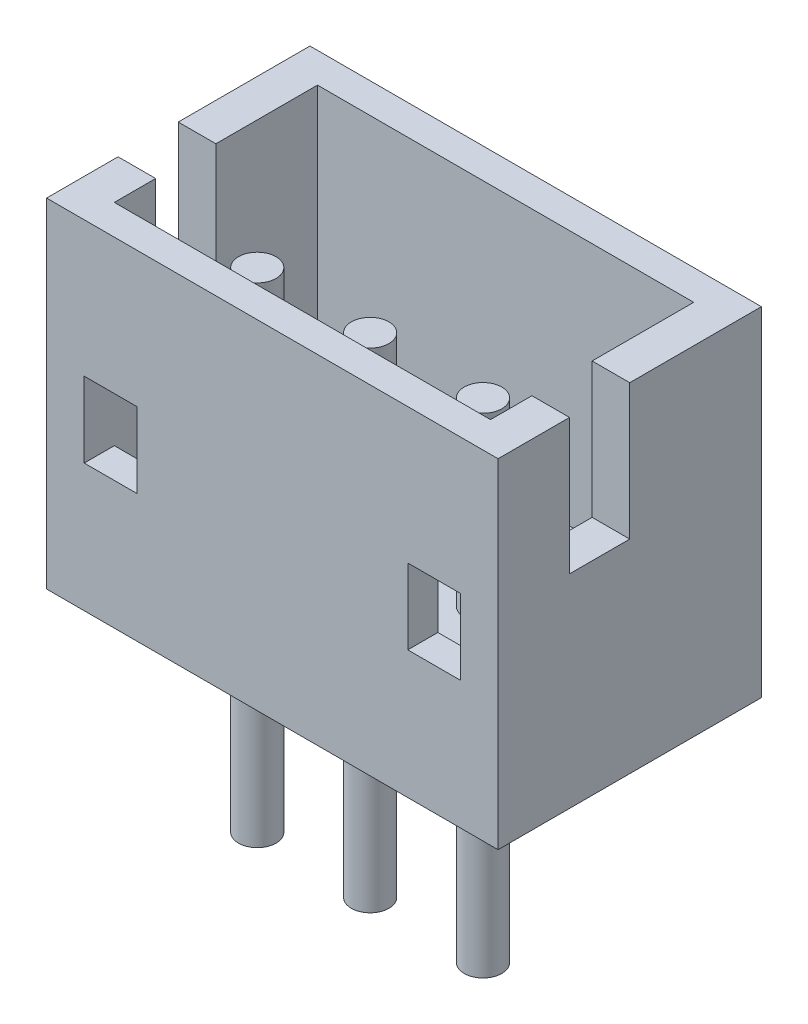
ISO-10303-21;
HEADER;
FILE_DESCRIPTION(('STEP AP214'),'2;1');
FILE_NAME('part.step','',(''),(''),'','','');
FILE_SCHEMA(('AUTOMOTIVE_DESIGN { 1 0 10303 214 1 1 1 1 }'));
ENDSEC;
DATA;
#1=APPLICATION_CONTEXT('core data for automotive mechanical design processes');
#2=APPLICATION_PROTOCOL_DEFINITION('international standard','automotive_design',2000,#1);
#3=PRODUCT_CONTEXT('',#1,'mechanical');
#4=PRODUCT('Part','Part','',(#3));
#5=PRODUCT_RELATED_PRODUCT_CATEGORY('part','',(#4));
#6=PRODUCT_DEFINITION_FORMATION('','',#4);
#7=PRODUCT_DEFINITION_CONTEXT('part definition',#1,'design');
#8=PRODUCT_DEFINITION('design','',#6,#7);
#9=PRODUCT_DEFINITION_SHAPE('','',#8);
#10=(LENGTH_UNIT() NAMED_UNIT(*) SI_UNIT(.MILLI.,.METRE.));
#11=(NAMED_UNIT(*) PLANE_ANGLE_UNIT() SI_UNIT($,.RADIAN.));
#12=(NAMED_UNIT(*) SI_UNIT($,.STERADIAN.) SOLID_ANGLE_UNIT());
#13=UNCERTAINTY_MEASURE_WITH_UNIT(LENGTH_MEASURE(1.E-05),#10,'distance_accuracy_value','');
#14=(GEOMETRIC_REPRESENTATION_CONTEXT(3) GLOBAL_UNCERTAINTY_ASSIGNED_CONTEXT((#13)) GLOBAL_UNIT_ASSIGNED_CONTEXT((#10,
#11,#12)) REPRESENTATION_CONTEXT('',''));
#15=CARTESIAN_POINT('',(0.,0.,0.));
#16=DIRECTION('',(0.,0.,1.));
#17=DIRECTION('',(1.,0.,0.));
#18=AXIS2_PLACEMENT_3D('',#15,#16,#17);
#19=CARTESIAN_POINT('',(1.8,4.5,-0.4));
#20=DIRECTION('',(0.,1.,0.));
#21=DIRECTION('',(0.,0.,1.));
#22=AXIS2_PLACEMENT_3D('',#19,#20,#21);
#23=PLANE('',#22);
#24=DIRECTION('',(-1.,0.,0.));
#25=VECTOR('',#24,1.);
#26=CARTESIAN_POINT('',(3.,4.5,-0.95));
#27=LINE('',#26,#25);
#28=CARTESIAN_POINT('',(-2.5,4.5,-0.95));
#29=VERTEX_POINT('',#28);
#30=CARTESIAN_POINT('',(-3.,4.5,-0.95));
#31=VERTEX_POINT('',#30);
#32=EDGE_CURVE('E209',#29,#31,#27,.T.);
#33=ORIENTED_EDGE('',*,*,#32,.T.);
#34=DIRECTION('',(0.,0.,-1.));
#35=VECTOR('',#34,1.);
#36=CARTESIAN_POINT('',(-3.,4.5,-3.1));
#37=LINE('',#36,#35);
#38=CARTESIAN_POINT('',(-3.,4.5,0.));
#39=VERTEX_POINT('',#38);
#40=EDGE_CURVE('E224',#39,#31,#37,.T.);
#41=ORIENTED_EDGE('',*,*,#40,.F.);
#42=DIRECTION('',(-1.,0.,0.));
#43=VECTOR('',#42,1.);
#44=CARTESIAN_POINT('',(1.8,4.5,0.));
#45=LINE('',#44,#43);
#46=CARTESIAN_POINT('',(3.,4.5,0.));
#47=VERTEX_POINT('',#46);
#48=EDGE_CURVE('E319',#47,#39,#45,.T.);
#49=ORIENTED_EDGE('',*,*,#48,.F.);
#50=DIRECTION('',(0.,0.,1.));
#51=VECTOR('',#50,1.);
#52=CARTESIAN_POINT('',(3.,4.5,0.));
#53=LINE('',#52,#51);
#54=CARTESIAN_POINT('',(3.,4.5,-0.95));
#55=VERTEX_POINT('',#54);
#56=EDGE_CURVE('E265',#55,#47,#53,.T.);
#57=ORIENTED_EDGE('',*,*,#56,.F.);
#58=DIRECTION('',(1.,0.,0.));
#59=VECTOR('',#58,1.);
#60=CARTESIAN_POINT('',(-3.001,4.5,-0.95));
#61=LINE('',#60,#59);
#62=CARTESIAN_POINT('',(2.5,4.5,-0.95));
#63=VERTEX_POINT('',#62);
#64=EDGE_CURVE('E55',#63,#55,#61,.T.);
#65=ORIENTED_EDGE('',*,*,#64,.F.);
#66=DIRECTION('',(0.,0.,1.));
#67=VECTOR('',#66,1.);
#68=CARTESIAN_POINT('',(2.5,4.5,0.));
#69=LINE('',#68,#67);
#70=CARTESIAN_POINT('',(2.5,4.5,-0.400000000000001));
#71=VERTEX_POINT('',#70);
#72=EDGE_CURVE('E273',#63,#71,#69,.T.);
#73=ORIENTED_EDGE('',*,*,#72,.T.);
#74=DIRECTION('',(-1.,0.,0.));
#75=VECTOR('',#74,1.);
#76=CARTESIAN_POINT('',(1.8,4.5,-0.4));
#77=LINE('',#76,#75);
#78=CARTESIAN_POINT('',(-2.5,4.5,-0.4));
#79=VERTEX_POINT('',#78);
#80=EDGE_CURVE('E311',#71,#79,#77,.T.);
#81=ORIENTED_EDGE('',*,*,#80,.T.);
#82=DIRECTION('',(0.,0.,-1.));
#83=VECTOR('',#82,1.);
#84=CARTESIAN_POINT('',(-2.5,4.5,-3.1));
#85=LINE('',#84,#83);
#86=EDGE_CURVE('E227',#79,#29,#85,.T.);
#87=ORIENTED_EDGE('',*,*,#86,.T.);
#88=EDGE_LOOP('',(#33,#41,#49,#57,#65,#73,#81,#87));
#89=FACE_BOUND('',#88,.T.);
#90=ADVANCED_FACE('F32',(#89),#23,.T.);
#91=CARTESIAN_POINT('',(0.,0.,-0.4));
#92=DIRECTION('',(0.,0.,1.));
#93=DIRECTION('',(1.,0.,0.));
#94=AXIS2_PLACEMENT_3D('',#91,#92,#93);
#95=PLANE('',#94);
#96=DIRECTION('',(1.,0.,0.));
#97=VECTOR('',#96,1.);
#98=CARTESIAN_POINT('',(-2.5,1.4,-0.4));
#99=LINE('',#98,#97);
#100=CARTESIAN_POINT('',(-2.5,1.4,-0.4));
#101=VERTEX_POINT('',#100);
#102=CARTESIAN_POINT('',(2.5,1.4,-0.4));
#103=VERTEX_POINT('',#102);
#104=EDGE_CURVE('E426',#101,#103,#99,.T.);
#105=ORIENTED_EDGE('',*,*,#104,.F.);
#106=DIRECTION('',(0.,1.,0.));
#107=VECTOR('',#106,1.);
#108=CARTESIAN_POINT('',(-2.5,1.1,-0.4));
#109=LINE('',#108,#107);
#110=CARTESIAN_POINT('',(-2.5,1.7,-0.4));
#111=VERTEX_POINT('',#110);
#112=EDGE_CURVE('E344',#101,#111,#109,.T.);
#113=ORIENTED_EDGE('',*,*,#112,.T.);
#114=DIRECTION('',(1.,0.,0.));
#115=VECTOR('',#114,1.);
#116=CARTESIAN_POINT('',(-2.5,1.7,-0.4));
#117=LINE('',#116,#115);
#118=CARTESIAN_POINT('',(-1.8,1.7,-0.4));
#119=VERTEX_POINT('',#118);
#120=EDGE_CURVE('E333',#111,#119,#117,.T.);
#121=ORIENTED_EDGE('',*,*,#120,.T.);
#122=DIRECTION('',(0.,-1.,0.));
#123=VECTOR('',#122,1.);
#124=CARTESIAN_POINT('',(-1.8,4.5,-0.4));
#125=LINE('',#124,#123);
#126=CARTESIAN_POINT('',(-1.8,2.7,-0.4));
#127=VERTEX_POINT('',#126);
#128=EDGE_CURVE('E314',#127,#119,#125,.T.);
#129=ORIENTED_EDGE('',*,*,#128,.F.);
#130=DIRECTION('',(1.,0.,0.));
#131=VECTOR('',#130,1.);
#132=CARTESIAN_POINT('',(-2.5,2.7,-0.4));
#133=LINE('',#132,#131);
#134=CARTESIAN_POINT('',(-2.5,2.7,-0.4));
#135=VERTEX_POINT('',#134);
#136=EDGE_CURVE('E300',#135,#127,#133,.T.);
#137=ORIENTED_EDGE('',*,*,#136,.F.);
#138=DIRECTION('',(0.,-1.,0.));
#139=VECTOR('',#138,1.);
#140=CARTESIAN_POINT('',(-2.5,2.7,-0.4));
#141=LINE('',#140,#139);
#142=EDGE_CURVE('E297',#79,#135,#141,.T.);
#143=ORIENTED_EDGE('',*,*,#142,.F.);
#144=ORIENTED_EDGE('',*,*,#80,.F.);
#145=DIRECTION('',(0.,1.,0.));
#146=VECTOR('',#145,1.);
#147=CARTESIAN_POINT('',(2.5,4.5,-0.400000000000001));
#148=LINE('',#147,#146);
#149=CARTESIAN_POINT('',(2.5,2.7,-0.400000000000001));
#150=VERTEX_POINT('',#149);
#151=EDGE_CURVE('E282',#150,#71,#148,.T.);
#152=ORIENTED_EDGE('',*,*,#151,.F.);
#153=DIRECTION('',(-1.,0.,0.));
#154=VECTOR('',#153,1.);
#155=CARTESIAN_POINT('',(2.5,2.7,-0.400000000000001));
#156=LINE('',#155,#154);
#157=CARTESIAN_POINT('',(1.8,2.7,-0.400000000000001));
#158=VERTEX_POINT('',#157);
#159=EDGE_CURVE('E285',#150,#158,#156,.T.);
#160=ORIENTED_EDGE('',*,*,#159,.T.);
#161=DIRECTION('',(0.,1.,0.));
#162=VECTOR('',#161,1.);
#163=CARTESIAN_POINT('',(1.8,1.7,-0.4));
#164=LINE('',#163,#162);
#165=CARTESIAN_POINT('',(1.8,1.7,-0.4));
#166=VERTEX_POINT('',#165);
#167=EDGE_CURVE('E309',#166,#158,#164,.T.);
#168=ORIENTED_EDGE('',*,*,#167,.F.);
#169=CARTESIAN_POINT('',(2.5,1.7,-0.400000000000001));
#170=VERTEX_POINT('',#169);
#171=EDGE_CURVE('E346',#166,#170,#117,.T.);
#172=ORIENTED_EDGE('',*,*,#171,.T.);
#173=DIRECTION('',(0.,1.,0.));
#174=VECTOR('',#173,1.);
#175=CARTESIAN_POINT('',(2.5,1.1,-0.400000000000001));
#176=LINE('',#175,#174);
#177=EDGE_CURVE('E358',#103,#170,#176,.T.);
#178=ORIENTED_EDGE('',*,*,#177,.F.);
#179=EDGE_LOOP('',(#105,#113,#121,#129,#137,#143,#144,#152,#160,#168,#172,#178));
#180=FACE_BOUND('',#179,.T.);
#181=ADVANCED_FACE('F343',(#180),#95,.F.);
#182=CARTESIAN_POINT('',(2.5,0.,0.));
#183=DIRECTION('',(-1.,0.,0.));
#184=DIRECTION('',(0.,-1.,0.));
#185=AXIS2_PLACEMENT_3D('',#182,#183,#184);
#186=PLANE('',#185);
#187=DIRECTION('',(0.,1.,0.));
#188=VECTOR('',#187,1.);
#189=CARTESIAN_POINT('',(2.5,2.69999999999999,-1.75));
#190=LINE('',#189,#188);
#191=CARTESIAN_POINT('',(2.5,2.7,-1.75));
#192=VERTEX_POINT('',#191);
#193=CARTESIAN_POINT('',(2.5,4.5,-1.75));
#194=VERTEX_POINT('',#193);
#195=EDGE_CURVE('E401',#192,#194,#190,.T.);
#196=ORIENTED_EDGE('',*,*,#195,.T.);
#197=CARTESIAN_POINT('',(2.5,4.5,-3.1));
#198=VERTEX_POINT('',#197);
#199=EDGE_CURVE('E274',#198,#194,#69,.T.);
#200=ORIENTED_EDGE('',*,*,#199,.F.);
#201=DIRECTION('',(0.,1.,0.));
#202=VECTOR('',#201,1.);
#203=CARTESIAN_POINT('',(2.5,4.5,-3.1));
#204=LINE('',#203,#202);
#205=CARTESIAN_POINT('',(2.5,1.1,-3.1));
#206=VERTEX_POINT('',#205);
#207=EDGE_CURVE('E270',#206,#198,#204,.T.);
#208=ORIENTED_EDGE('',*,*,#207,.F.);
#209=DIRECTION('',(0.,0.,-1.));
#210=VECTOR('',#209,1.);
#211=CARTESIAN_POINT('',(2.5,1.1,-0.400000000000001));
#212=LINE('',#211,#210);
#213=CARTESIAN_POINT('',(2.5,1.1,-2.05));
#214=VERTEX_POINT('',#213);
#215=EDGE_CURVE('E345',#214,#206,#212,.T.);
#216=ORIENTED_EDGE('',*,*,#215,.F.);
#217=DIRECTION('',(0.,-0.707106781186544,-0.707106781186551));
#218=VECTOR('',#217,1.);
#219=CARTESIAN_POINT('',(2.5,1.1,-2.05));
#220=LINE('',#219,#218);
#221=CARTESIAN_POINT('',(2.5,1.4,-1.75));
#222=VERTEX_POINT('',#221);
#223=EDGE_CURVE('E423',#222,#214,#220,.T.);
#224=ORIENTED_EDGE('',*,*,#223,.F.);
#225=DIRECTION('',(0.,0.,-1.));
#226=VECTOR('',#225,1.);
#227=CARTESIAN_POINT('',(2.5,1.4,-1.75));
#228=LINE('',#227,#226);
#229=EDGE_CURVE('E396',#103,#222,#228,.T.);
#230=ORIENTED_EDGE('',*,*,#229,.F.);
#231=ORIENTED_EDGE('',*,*,#177,.T.);
#232=DIRECTION('',(0.,0.,-1.));
#233=VECTOR('',#232,1.);
#234=CARTESIAN_POINT('',(2.5,1.7,-3.1));
#235=LINE('',#234,#233);
#236=CARTESIAN_POINT('',(2.5,1.7,0.));
#237=VERTEX_POINT('',#236);
#238=EDGE_CURVE('E257',#237,#170,#235,.T.);
#239=ORIENTED_EDGE('',*,*,#238,.F.);
#240=DIRECTION('',(0.,-1.,0.));
#241=VECTOR('',#240,1.);
#242=CARTESIAN_POINT('',(2.5,1.7,0.));
#243=LINE('',#242,#241);
#244=CARTESIAN_POINT('',(2.5,2.7,0.));
#245=VERTEX_POINT('',#244);
#246=EDGE_CURVE('E277',#245,#237,#243,.T.);
#247=ORIENTED_EDGE('',*,*,#246,.F.);
#248=DIRECTION('',(0.,0.,-1.));
#249=VECTOR('',#248,1.);
#250=CARTESIAN_POINT('',(2.5,2.7,-0.400000000000001));
#251=LINE('',#250,#249);
#252=EDGE_CURVE('E279',#245,#150,#251,.T.);
#253=ORIENTED_EDGE('',*,*,#252,.T.);
#254=ORIENTED_EDGE('',*,*,#151,.T.);
#255=ORIENTED_EDGE('',*,*,#72,.F.);
#256=DIRECTION('',(0.,-1.,0.));
#257=VECTOR('',#256,1.);
#258=CARTESIAN_POINT('',(2.5,4.49999999999999,-0.95));
#259=LINE('',#258,#257);
#260=CARTESIAN_POINT('',(2.5,2.7,-0.95));
#261=VERTEX_POINT('',#260);
#262=EDGE_CURVE('E410',#63,#261,#259,.T.);
#263=ORIENTED_EDGE('',*,*,#262,.T.);
#264=DIRECTION('',(0.,0.,-1.));
#265=VECTOR('',#264,1.);
#266=CARTESIAN_POINT('',(2.5,2.7,-0.95));
#267=LINE('',#266,#265);
#268=EDGE_CURVE('E406',#261,#192,#267,.T.);
#269=ORIENTED_EDGE('',*,*,#268,.T.);
#270=EDGE_LOOP('',(#196,#200,#208,#216,#224,#230,#231,#239,#247,#253,#254,#255,#263,#269));
#271=FACE_BOUND('',#270,.T.);
#272=ADVANCED_FACE('F453',(#271),#186,.T.);
#273=CARTESIAN_POINT('',(-2.5,0.,0.));
#274=DIRECTION('',(1.,0.,0.));
#275=DIRECTION('',(0.,0.,-1.));
#276=AXIS2_PLACEMENT_3D('',#273,#274,#275);
#277=PLANE('',#276);
#278=DIRECTION('',(0.,-1.,0.));
#279=VECTOR('',#278,1.);
#280=CARTESIAN_POINT('',(-2.5,0.,-0.95));
#281=LINE('',#280,#279);
#282=CARTESIAN_POINT('',(-2.5,2.7,-0.95));
#283=VERTEX_POINT('',#282);
#284=EDGE_CURVE('E405',#29,#283,#281,.T.);
#285=ORIENTED_EDGE('',*,*,#284,.F.);
#286=ORIENTED_EDGE('',*,*,#86,.F.);
#287=ORIENTED_EDGE('',*,*,#142,.T.);
#288=DIRECTION('',(0.,0.,1.));
#289=VECTOR('',#288,1.);
#290=CARTESIAN_POINT('',(-2.5,2.7,0.));
#291=LINE('',#290,#289);
#292=CARTESIAN_POINT('',(-2.5,2.7,0.));
#293=VERTEX_POINT('',#292);
#294=EDGE_CURVE('E294',#135,#293,#291,.T.);
#295=ORIENTED_EDGE('',*,*,#294,.T.);
#296=DIRECTION('',(0.,1.,0.));
#297=VECTOR('',#296,1.);
#298=CARTESIAN_POINT('',(-2.5,4.5,0.));
#299=LINE('',#298,#297);
#300=CARTESIAN_POINT('',(-2.5,1.7,0.));
#301=VERTEX_POINT('',#300);
#302=EDGE_CURVE('E243',#301,#293,#299,.T.);
#303=ORIENTED_EDGE('',*,*,#302,.F.);
#304=DIRECTION('',(0.,0.,-1.));
#305=VECTOR('',#304,1.);
#306=CARTESIAN_POINT('',(-2.5,1.7,-3.1));
#307=LINE('',#306,#305);
#308=EDGE_CURVE('E256',#301,#111,#307,.T.);
#309=ORIENTED_EDGE('',*,*,#308,.T.);
#310=ORIENTED_EDGE('',*,*,#112,.F.);
#311=DIRECTION('',(0.,0.,-1.));
#312=VECTOR('',#311,1.);
#313=CARTESIAN_POINT('',(-2.5,1.4,-1.75));
#314=LINE('',#313,#312);
#315=CARTESIAN_POINT('',(-2.5,1.4,-1.75));
#316=VERTEX_POINT('',#315);
#317=EDGE_CURVE('E419',#101,#316,#314,.T.);
#318=ORIENTED_EDGE('',*,*,#317,.T.);
#319=DIRECTION('',(0.,-0.707106781186544,-0.707106781186551));
#320=VECTOR('',#319,1.);
#321=CARTESIAN_POINT('',(-2.5,1.1,-2.05));
#322=LINE('',#321,#320);
#323=CARTESIAN_POINT('',(-2.5,1.1,-2.05));
#324=VERTEX_POINT('',#323);
#325=EDGE_CURVE('E422',#316,#324,#322,.T.);
#326=ORIENTED_EDGE('',*,*,#325,.T.);
#327=DIRECTION('',(0.,0.,1.));
#328=VECTOR('',#327,1.);
#329=CARTESIAN_POINT('',(-2.5,1.1,-3.1));
#330=LINE('',#329,#328);
#331=CARTESIAN_POINT('',(-2.5,1.1,-3.1));
#332=VERTEX_POINT('',#331);
#333=EDGE_CURVE('E354',#332,#324,#330,.T.);
#334=ORIENTED_EDGE('',*,*,#333,.F.);
#335=DIRECTION('',(0.,-1.,0.));
#336=VECTOR('',#335,1.);
#337=CARTESIAN_POINT('',(-2.5,0.,-3.1));
#338=LINE('',#337,#336);
#339=CARTESIAN_POINT('',(-2.5,4.5,-3.1));
#340=VERTEX_POINT('',#339);
#341=EDGE_CURVE('E249',#340,#332,#338,.T.);
#342=ORIENTED_EDGE('',*,*,#341,.F.);
#343=CARTESIAN_POINT('',(-2.5,4.5,-1.75));
#344=VERTEX_POINT('',#343);
#345=EDGE_CURVE('E246',#344,#340,#85,.T.);
#346=ORIENTED_EDGE('',*,*,#345,.F.);
#347=DIRECTION('',(0.,1.,0.));
#348=VECTOR('',#347,1.);
#349=CARTESIAN_POINT('',(-2.5,0.,-1.75));
#350=LINE('',#349,#348);
#351=CARTESIAN_POINT('',(-2.5,2.7,-1.75));
#352=VERTEX_POINT('',#351);
#353=EDGE_CURVE('E462',#352,#344,#350,.T.);
#354=ORIENTED_EDGE('',*,*,#353,.F.);
#355=DIRECTION('',(0.,0.,-1.));
#356=VECTOR('',#355,1.);
#357=CARTESIAN_POINT('',(-2.5,2.7,0.));
#358=LINE('',#357,#356);
#359=EDGE_CURVE('E463',#283,#352,#358,.T.);
#360=ORIENTED_EDGE('',*,*,#359,.F.);
#361=EDGE_LOOP('',(#285,#286,#287,#295,#303,#309,#310,#318,#326,#334,#342,#346,#354,#360));
#362=FACE_BOUND('',#361,.T.);
#363=ADVANCED_FACE('F337',(#362),#277,.T.);
#364=CARTESIAN_POINT('',(0.,1.1,0.));
#365=DIRECTION('',(0.,1.,0.));
#366=DIRECTION('',(0.,0.,1.));
#367=AXIS2_PLACEMENT_3D('',#364,#365,#366);
#368=PLANE('',#367);
#369=ORIENTED_EDGE('',*,*,#333,.T.);
#370=DIRECTION('',(1.,0.,0.));
#371=VECTOR('',#370,1.);
#372=CARTESIAN_POINT('',(-2.5,1.1,-2.05));
#373=LINE('',#372,#371);
#374=EDGE_CURVE('E431',#324,#214,#373,.T.);
#375=ORIENTED_EDGE('',*,*,#374,.T.);
#376=ORIENTED_EDGE('',*,*,#215,.T.);
#377=DIRECTION('',(-1.,0.,0.));
#378=VECTOR('',#377,1.);
#379=CARTESIAN_POINT('',(2.5,1.1,-3.1));
#380=LINE('',#379,#378);
#381=EDGE_CURVE('E348',#206,#332,#380,.T.);
#382=ORIENTED_EDGE('',*,*,#381,.T.);
#383=EDGE_LOOP('',(#369,#375,#376,#382));
#384=FACE_BOUND('',#383,.T.);
#385=ADVANCED_FACE('F439',(#384),#368,.T.);
#386=CARTESIAN_POINT('',(0.,1.7,0.));
#387=DIRECTION('',(0.,1.,0.));
#388=DIRECTION('',(0.,0.,1.));
#389=AXIS2_PLACEMENT_3D('',#386,#387,#388);
#390=PLANE('',#389);
#391=ORIENTED_EDGE('',*,*,#120,.F.);
#392=ORIENTED_EDGE('',*,*,#308,.F.);
#393=DIRECTION('',(-1.,0.,0.));
#394=VECTOR('',#393,1.);
#395=CARTESIAN_POINT('',(-2.5,1.7,0.));
#396=LINE('',#395,#394);
#397=CARTESIAN_POINT('',(-1.8,1.7,0.));
#398=VERTEX_POINT('',#397);
#399=EDGE_CURVE('E235',#398,#301,#396,.T.);
#400=ORIENTED_EDGE('',*,*,#399,.F.);
#401=DIRECTION('',(0.,0.,1.));
#402=VECTOR('',#401,1.);
#403=CARTESIAN_POINT('',(-1.8,1.7,-0.4));
#404=LINE('',#403,#402);
#405=EDGE_CURVE('E36',#119,#398,#404,.T.);
#406=ORIENTED_EDGE('',*,*,#405,.F.);
#407=EDGE_LOOP('',(#391,#392,#400,#406));
#408=FACE_BOUND('',#407,.T.);
#409=ADVANCED_FACE('F332',(#408),#390,.T.);
#410=CARTESIAN_POINT('',(1.8,1.7,-0.4));
#411=DIRECTION('',(1.,0.,0.));
#412=DIRECTION('',(0.,1.,0.));
#413=AXIS2_PLACEMENT_3D('',#410,#411,#412);
#414=PLANE('',#413);
#415=DIRECTION('',(0.,0.,-1.));
#416=VECTOR('',#415,1.);
#417=CARTESIAN_POINT('',(1.8,2.7,-0.400000000000001));
#418=LINE('',#417,#416);
#419=CARTESIAN_POINT('',(1.8,2.7,0.));
#420=VERTEX_POINT('',#419);
#421=EDGE_CURVE('E267',#420,#158,#418,.T.);
#422=ORIENTED_EDGE('',*,*,#421,.F.);
#423=DIRECTION('',(0.,1.,0.));
#424=VECTOR('',#423,1.);
#425=CARTESIAN_POINT('',(1.8,1.7,0.));
#426=LINE('',#425,#424);
#427=CARTESIAN_POINT('',(1.8,1.7,0.));
#428=VERTEX_POINT('',#427);
#429=EDGE_CURVE('E308',#428,#420,#426,.T.);
#430=ORIENTED_EDGE('',*,*,#429,.F.);
#431=DIRECTION('',(0.,0.,1.));
#432=VECTOR('',#431,1.);
#433=CARTESIAN_POINT('',(1.8,1.7,-0.4));
#434=LINE('',#433,#432);
#435=EDGE_CURVE('E11',#166,#428,#434,.T.);
#436=ORIENTED_EDGE('',*,*,#435,.F.);
#437=ORIENTED_EDGE('',*,*,#167,.T.);
#438=EDGE_LOOP('',(#422,#430,#436,#437));
#439=FACE_BOUND('',#438,.T.);
#440=ADVANCED_FACE('F34',(#439),#414,.T.);
#441=CARTESIAN_POINT('',(-1.8,4.5,-0.4));
#442=DIRECTION('',(-1.,0.,0.));
#443=DIRECTION('',(0.,-1.,0.));
#444=AXIS2_PLACEMENT_3D('',#441,#442,#443);
#445=PLANE('',#444);
#446=DIRECTION('',(0.,0.,1.));
#447=VECTOR('',#446,1.);
#448=CARTESIAN_POINT('',(-1.8,2.7,0.));
#449=LINE('',#448,#447);
#450=CARTESIAN_POINT('',(-1.8,2.7,0.));
#451=VERTEX_POINT('',#450);
#452=EDGE_CURVE('E293',#127,#451,#449,.T.);
#453=ORIENTED_EDGE('',*,*,#452,.F.);
#454=ORIENTED_EDGE('',*,*,#128,.T.);
#455=ORIENTED_EDGE('',*,*,#405,.T.);
#456=DIRECTION('',(0.,-1.,0.));
#457=VECTOR('',#456,1.);
#458=CARTESIAN_POINT('',(-1.8,4.5,0.));
#459=LINE('',#458,#457);
#460=EDGE_CURVE('E312',#451,#398,#459,.T.);
#461=ORIENTED_EDGE('',*,*,#460,.F.);
#462=EDGE_LOOP('',(#453,#454,#455,#461));
#463=FACE_BOUND('',#462,.T.);
#464=ADVANCED_FACE('F328',(#463),#445,.T.);
#465=DIRECTION('',(-1.,0.,0.));
#466=VECTOR('',#465,1.);
#467=CARTESIAN_POINT('',(3.,4.5,-1.75));
#468=LINE('',#467,#466);
#469=CARTESIAN_POINT('',(-3.,4.5,-1.75));
#470=VERTEX_POINT('',#469);
#471=EDGE_CURVE('E47',#344,#470,#468,.T.);
#472=ORIENTED_EDGE('',*,*,#471,.F.);
#473=ORIENTED_EDGE('',*,*,#345,.T.);
#474=DIRECTION('',(1.,0.,0.));
#475=VECTOR('',#474,1.);
#476=CARTESIAN_POINT('',(3.,4.5,-3.1));
#477=LINE('',#476,#475);
#478=EDGE_CURVE('E357',#340,#198,#477,.T.);
#479=ORIENTED_EDGE('',*,*,#478,.T.);
#480=ORIENTED_EDGE('',*,*,#199,.T.);
#481=DIRECTION('',(1.,0.,0.));
#482=VECTOR('',#481,1.);
#483=CARTESIAN_POINT('',(-3.001,4.5,-1.75));
#484=LINE('',#483,#482);
#485=CARTESIAN_POINT('',(3.,4.5,-1.75));
#486=VERTEX_POINT('',#485);
#487=EDGE_CURVE('E404',#194,#486,#484,.T.);
#488=ORIENTED_EDGE('',*,*,#487,.T.);
#489=CARTESIAN_POINT('',(3.,4.5,-3.5));
#490=VERTEX_POINT('',#489);
#491=EDGE_CURVE('E261',#490,#486,#53,.T.);
#492=ORIENTED_EDGE('',*,*,#491,.F.);
#493=DIRECTION('',(1.,0.,0.));
#494=VECTOR('',#493,1.);
#495=CARTESIAN_POINT('',(3.,4.5,-3.5));
#496=LINE('',#495,#494);
#497=CARTESIAN_POINT('',(-3.,4.5,-3.5));
#498=VERTEX_POINT('',#497);
#499=EDGE_CURVE('E247',#498,#490,#496,.T.);
#500=ORIENTED_EDGE('',*,*,#499,.F.);
#501=EDGE_CURVE('E236',#470,#498,#37,.T.);
#502=ORIENTED_EDGE('',*,*,#501,.F.);
#503=EDGE_LOOP('',(#472,#473,#479,#480,#488,#492,#500,#502));
#504=FACE_BOUND('',#503,.T.);
#505=ADVANCED_FACE('F458',(#504),#23,.T.);
#506=CARTESIAN_POINT('',(0.,0.,0.));
#507=DIRECTION('',(0.,0.,1.));
#508=DIRECTION('',(1.,0.,0.));
#509=AXIS2_PLACEMENT_3D('',#506,#507,#508);
#510=PLANE('',#509);
#511=ORIENTED_EDGE('',*,*,#48,.T.);
#512=DIRECTION('',(0.,1.,0.));
#513=VECTOR('',#512,1.);
#514=CARTESIAN_POINT('',(-3.,4.5,0.));
#515=LINE('',#514,#513);
#516=CARTESIAN_POINT('',(-3.,0.,0.));
#517=VERTEX_POINT('',#516);
#518=EDGE_CURVE('E234',#517,#39,#515,.T.);
#519=ORIENTED_EDGE('',*,*,#518,.F.);
#520=DIRECTION('',(-1.,0.,0.));
#521=VECTOR('',#520,1.);
#522=CARTESIAN_POINT('',(-2.5,0.,0.));
#523=LINE('',#522,#521);
#524=CARTESIAN_POINT('',(3.,0.,0.));
#525=VERTEX_POINT('',#524);
#526=EDGE_CURVE('E255',#525,#517,#523,.T.);
#527=ORIENTED_EDGE('',*,*,#526,.F.);
#528=DIRECTION('',(0.,-1.,0.));
#529=VECTOR('',#528,1.);
#530=CARTESIAN_POINT('',(3.,1.7,0.));
#531=LINE('',#530,#529);
#532=EDGE_CURVE('E264',#47,#525,#531,.T.);
#533=ORIENTED_EDGE('',*,*,#532,.F.);
#534=EDGE_LOOP('',(#511,#519,#527,#533));
#535=FACE_BOUND('',#534,.T.);
#536=EDGE_CURVE('E238',#237,#428,#396,.T.);
#537=ORIENTED_EDGE('',*,*,#536,.T.);
#538=ORIENTED_EDGE('',*,*,#429,.T.);
#539=DIRECTION('',(-1.,0.,0.));
#540=VECTOR('',#539,1.);
#541=CARTESIAN_POINT('',(2.5,2.7,0.));
#542=LINE('',#541,#540);
#543=EDGE_CURVE('E290',#245,#420,#542,.T.);
#544=ORIENTED_EDGE('',*,*,#543,.F.);
#545=ORIENTED_EDGE('',*,*,#246,.T.);
#546=EDGE_LOOP('',(#537,#538,#544,#545));
#547=FACE_BOUND('',#546,.T.);
#548=ORIENTED_EDGE('',*,*,#460,.T.);
#549=ORIENTED_EDGE('',*,*,#399,.T.);
#550=ORIENTED_EDGE('',*,*,#302,.T.);
#551=DIRECTION('',(1.,0.,0.));
#552=VECTOR('',#551,1.);
#553=CARTESIAN_POINT('',(-2.5,2.7,0.));
#554=LINE('',#553,#552);
#555=EDGE_CURVE('E305',#293,#451,#554,.T.);
#556=ORIENTED_EDGE('',*,*,#555,.T.);
#557=EDGE_LOOP('',(#548,#549,#550,#556));
#558=FACE_BOUND('',#557,.T.);
#559=ADVANCED_FACE('F324',(#535,#547,#558),#510,.T.);
#560=CARTESIAN_POINT('',(-2.5,2.7,0.));
#561=DIRECTION('',(0.,1.,0.));
#562=DIRECTION('',(-1.,0.,0.));
#563=AXIS2_PLACEMENT_3D('',#560,#561,#562);
#564=PLANE('',#563);
#565=ORIENTED_EDGE('',*,*,#452,.T.);
#566=ORIENTED_EDGE('',*,*,#555,.F.);
#567=ORIENTED_EDGE('',*,*,#294,.F.);
#568=ORIENTED_EDGE('',*,*,#136,.T.);
#569=EDGE_LOOP('',(#565,#566,#567,#568));
#570=FACE_BOUND('',#569,.T.);
#571=ADVANCED_FACE('F340',(#570),#564,.F.);
#572=CARTESIAN_POINT('',(2.5,2.7,-0.400000000000001));
#573=DIRECTION('',(0.,1.,0.));
#574=DIRECTION('',(0.,0.,1.));
#575=AXIS2_PLACEMENT_3D('',#572,#573,#574);
#576=PLANE('',#575);
#577=ORIENTED_EDGE('',*,*,#421,.T.);
#578=ORIENTED_EDGE('',*,*,#159,.F.);
#579=ORIENTED_EDGE('',*,*,#252,.F.);
#580=ORIENTED_EDGE('',*,*,#543,.T.);
#581=EDGE_LOOP('',(#577,#578,#579,#580));
#582=FACE_BOUND('',#581,.T.);
#583=ADVANCED_FACE('F544',(#582),#576,.F.);
#584=CARTESIAN_POINT('',(3.,0.,0.));
#585=DIRECTION('',(-1.,0.,0.));
#586=DIRECTION('',(0.,-1.,0.));
#587=AXIS2_PLACEMENT_3D('',#584,#585,#586);
#588=PLANE('',#587);
#589=ORIENTED_EDGE('',*,*,#491,.T.);
#590=DIRECTION('',(0.,1.,0.));
#591=VECTOR('',#590,1.);
#592=CARTESIAN_POINT('',(3.,2.7,-1.75));
#593=LINE('',#592,#591);
#594=CARTESIAN_POINT('',(3.,2.7,-1.75));
#595=VERTEX_POINT('',#594);
#596=EDGE_CURVE('E394',#595,#486,#593,.T.);
#597=ORIENTED_EDGE('',*,*,#596,.F.);
#598=DIRECTION('',(0.,0.,-1.));
#599=VECTOR('',#598,1.);
#600=CARTESIAN_POINT('',(3.,2.7,-0.95));
#601=LINE('',#600,#599);
#602=CARTESIAN_POINT('',(3.,2.7,-0.95));
#603=VERTEX_POINT('',#602);
#604=EDGE_CURVE('E392',#603,#595,#601,.T.);
#605=ORIENTED_EDGE('',*,*,#604,.F.);
#606=DIRECTION('',(0.,-1.,0.));
#607=VECTOR('',#606,1.);
#608=CARTESIAN_POINT('',(3.,4.5,-0.95));
#609=LINE('',#608,#607);
#610=EDGE_CURVE('E390',#55,#603,#609,.T.);
#611=ORIENTED_EDGE('',*,*,#610,.F.);
#612=ORIENTED_EDGE('',*,*,#56,.T.);
#613=ORIENTED_EDGE('',*,*,#532,.T.);
#614=DIRECTION('',(0.,0.,1.));
#615=VECTOR('',#614,1.);
#616=CARTESIAN_POINT('',(3.,0.,0.));
#617=LINE('',#616,#615);
#618=CARTESIAN_POINT('',(3.,0.,-3.5));
#619=VERTEX_POINT('',#618);
#620=EDGE_CURVE('E252',#619,#525,#617,.T.);
#621=ORIENTED_EDGE('',*,*,#620,.F.);
#622=DIRECTION('',(0.,-1.,0.));
#623=VECTOR('',#622,1.);
#624=CARTESIAN_POINT('',(3.,0.,-3.5));
#625=LINE('',#624,#623);
#626=EDGE_CURVE('E360',#490,#619,#625,.T.);
#627=ORIENTED_EDGE('',*,*,#626,.F.);
#628=EDGE_LOOP('',(#589,#597,#605,#611,#612,#613,#621,#627));
#629=FACE_BOUND('',#628,.T.);
#630=ADVANCED_FACE('F382',(#629),#588,.F.);
#631=CARTESIAN_POINT('',(0.,0.,0.));
#632=DIRECTION('',(0.,1.,0.));
#633=DIRECTION('',(0.,0.,1.));
#634=AXIS2_PLACEMENT_3D('',#631,#632,#633);
#635=PLANE('',#634);
#636=CARTESIAN_POINT('',(1.5,0.,-1.3));
#637=DIRECTION('',(0.,1.,0.));
#638=DIRECTION('',(0.,0.,1.));
#639=AXIS2_PLACEMENT_3D('',#636,#637,#638);
#640=CIRCLE('',#639,0.25);
#641=CARTESIAN_POINT('',(1.5,0.,-1.05));
#642=VERTEX_POINT('',#641);
#643=EDGE_CURVE('E488',#642,#642,#640,.T.);
#644=ORIENTED_EDGE('',*,*,#643,.T.);
#645=EDGE_LOOP('',(#644));
#646=FACE_BOUND('',#645,.T.);
#647=CARTESIAN_POINT('',(0.,0.,-1.3));
#648=DIRECTION('',(0.,1.,0.));
#649=DIRECTION('',(0.,0.,1.));
#650=AXIS2_PLACEMENT_3D('',#647,#648,#649);
#651=CIRCLE('',#650,0.25);
#652=CARTESIAN_POINT('',(0.,0.,-1.05));
#653=VERTEX_POINT('',#652);
#654=EDGE_CURVE('E482',#653,#653,#651,.T.);
#655=ORIENTED_EDGE('',*,*,#654,.T.);
#656=EDGE_LOOP('',(#655));
#657=FACE_BOUND('',#656,.T.);
#658=CARTESIAN_POINT('',(-1.5,0.,-1.3));
#659=DIRECTION('',(0.,1.,0.));
#660=DIRECTION('',(-1.,0.,0.));
#661=AXIS2_PLACEMENT_3D('',#658,#659,#660);
#662=CIRCLE('',#661,0.25);
#663=CARTESIAN_POINT('',(-1.75,0.,-1.3));
#664=VERTEX_POINT('',#663);
#665=EDGE_CURVE('E476',#664,#664,#662,.T.);
#666=ORIENTED_EDGE('',*,*,#665,.T.);
#667=EDGE_LOOP('',(#666));
#668=FACE_BOUND('',#667,.T.);
#669=DIRECTION('',(0.,0.,1.));
#670=VECTOR('',#669,1.);
#671=CARTESIAN_POINT('',(-3.,0.,0.));
#672=LINE('',#671,#670);
#673=CARTESIAN_POINT('',(-3.,0.,-3.5));
#674=VERTEX_POINT('',#673);
#675=EDGE_CURVE('E251',#674,#517,#672,.T.);
#676=ORIENTED_EDGE('',*,*,#675,.F.);
#677=DIRECTION('',(-1.,0.,0.));
#678=VECTOR('',#677,1.);
#679=CARTESIAN_POINT('',(-3.,0.,-3.5));
#680=LINE('',#679,#678);
#681=EDGE_CURVE('E363',#619,#674,#680,.T.);
#682=ORIENTED_EDGE('',*,*,#681,.F.);
#683=ORIENTED_EDGE('',*,*,#620,.T.);
#684=ORIENTED_EDGE('',*,*,#526,.T.);
#685=EDGE_LOOP('',(#676,#682,#683,#684));
#686=FACE_BOUND('',#685,.T.);
#687=ADVANCED_FACE('F375',(#646,#657,#668,#686),#635,.F.);
#688=ORIENTED_EDGE('',*,*,#171,.F.);
#689=ORIENTED_EDGE('',*,*,#435,.T.);
#690=ORIENTED_EDGE('',*,*,#536,.F.);
#691=ORIENTED_EDGE('',*,*,#238,.T.);
#692=EDGE_LOOP('',(#688,#689,#690,#691));
#693=FACE_BOUND('',#692,.T.);
#694=ADVANCED_FACE('F552',(#693),#390,.T.);
#695=CARTESIAN_POINT('',(-3.,0.,0.));
#696=DIRECTION('',(1.,0.,0.));
#697=DIRECTION('',(0.,0.,-1.));
#698=AXIS2_PLACEMENT_3D('',#695,#696,#697);
#699=PLANE('',#698);
#700=ORIENTED_EDGE('',*,*,#40,.T.);
#701=DIRECTION('',(0.,1.,0.));
#702=VECTOR('',#701,1.);
#703=CARTESIAN_POINT('',(-3.,2.7,-0.95));
#704=LINE('',#703,#702);
#705=CARTESIAN_POINT('',(-3.,2.7,-0.95));
#706=VERTEX_POINT('',#705);
#707=EDGE_CURVE('E206',#706,#31,#704,.T.);
#708=ORIENTED_EDGE('',*,*,#707,.F.);
#709=DIRECTION('',(0.,0.,1.));
#710=VECTOR('',#709,1.);
#711=CARTESIAN_POINT('',(-3.,2.7,-1.75));
#712=LINE('',#711,#710);
#713=CARTESIAN_POINT('',(-3.,2.7,-1.75));
#714=VERTEX_POINT('',#713);
#715=EDGE_CURVE('E228',#714,#706,#712,.T.);
#716=ORIENTED_EDGE('',*,*,#715,.F.);
#717=DIRECTION('',(0.,-1.,0.));
#718=VECTOR('',#717,1.);
#719=CARTESIAN_POINT('',(-3.,4.5,-1.75));
#720=LINE('',#719,#718);
#721=EDGE_CURVE('E217',#470,#714,#720,.T.);
#722=ORIENTED_EDGE('',*,*,#721,.F.);
#723=ORIENTED_EDGE('',*,*,#501,.T.);
#724=DIRECTION('',(0.,1.,0.));
#725=VECTOR('',#724,1.);
#726=CARTESIAN_POINT('',(-3.,4.5,-3.5));
#727=LINE('',#726,#725);
#728=EDGE_CURVE('E366',#674,#498,#727,.T.);
#729=ORIENTED_EDGE('',*,*,#728,.F.);
#730=ORIENTED_EDGE('',*,*,#675,.T.);
#731=ORIENTED_EDGE('',*,*,#518,.T.);
#732=EDGE_LOOP('',(#700,#708,#716,#722,#723,#729,#730,#731));
#733=FACE_BOUND('',#732,.T.);
#734=ADVANCED_FACE('F231',(#733),#699,.F.);
#735=CARTESIAN_POINT('',(0.,0.,-3.5));
#736=DIRECTION('',(0.,0.,1.));
#737=DIRECTION('',(0.,-1.,0.));
#738=AXIS2_PLACEMENT_3D('',#735,#736,#737);
#739=PLANE('',#738);
#740=ORIENTED_EDGE('',*,*,#626,.T.);
#741=ORIENTED_EDGE('',*,*,#681,.T.);
#742=ORIENTED_EDGE('',*,*,#728,.T.);
#743=ORIENTED_EDGE('',*,*,#499,.T.);
#744=EDGE_LOOP('',(#740,#741,#742,#743));
#745=FACE_BOUND('',#744,.T.);
#746=ADVANCED_FACE('F378',(#745),#739,.F.);
#747=CARTESIAN_POINT('',(0.,0.,-3.1));
#748=DIRECTION('',(0.,0.,1.));
#749=DIRECTION('',(0.,-1.,0.));
#750=AXIS2_PLACEMENT_3D('',#747,#748,#749);
#751=PLANE('',#750);
#752=ORIENTED_EDGE('',*,*,#341,.T.);
#753=ORIENTED_EDGE('',*,*,#381,.F.);
#754=ORIENTED_EDGE('',*,*,#207,.T.);
#755=ORIENTED_EDGE('',*,*,#478,.F.);
#756=EDGE_LOOP('',(#752,#753,#754,#755));
#757=FACE_BOUND('',#756,.T.);
#758=ADVANCED_FACE('F456',(#757),#751,.T.);
#759=CARTESIAN_POINT('',(-2.5,1.4,-1.75));
#760=DIRECTION('',(0.,-1.,0.));
#761=DIRECTION('',(0.,0.,-1.));
#762=AXIS2_PLACEMENT_3D('',#759,#760,#761);
#763=PLANE('',#762);
#764=CARTESIAN_POINT('',(-1.5,1.4,-1.3));
#765=DIRECTION('',(0.,1.,0.));
#766=DIRECTION('',(0.,0.,1.));
#767=AXIS2_PLACEMENT_3D('',#764,#765,#766);
#768=CIRCLE('',#767,0.25);
#769=CARTESIAN_POINT('',(-1.5,1.4,-1.05));
#770=VERTEX_POINT('',#769);
#771=EDGE_CURVE('E503',#770,#770,#768,.T.);
#772=ORIENTED_EDGE('',*,*,#771,.F.);
#773=EDGE_LOOP('',(#772));
#774=FACE_BOUND('',#773,.T.);
#775=CARTESIAN_POINT('',(0.,1.4,-1.3));
#776=DIRECTION('',(0.,1.,0.));
#777=DIRECTION('',(0.,0.,1.));
#778=AXIS2_PLACEMENT_3D('',#775,#776,#777);
#779=CIRCLE('',#778,0.25);
#780=CARTESIAN_POINT('',(0.,1.4,-1.05));
#781=VERTEX_POINT('',#780);
#782=EDGE_CURVE('E497',#781,#781,#779,.T.);
#783=ORIENTED_EDGE('',*,*,#782,.F.);
#784=EDGE_LOOP('',(#783));
#785=FACE_BOUND('',#784,.T.);
#786=CARTESIAN_POINT('',(1.5,1.4,-1.3));
#787=DIRECTION('',(0.,1.,0.));
#788=DIRECTION('',(0.,0.,1.));
#789=AXIS2_PLACEMENT_3D('',#786,#787,#788);
#790=CIRCLE('',#789,0.25);
#791=CARTESIAN_POINT('',(1.5,1.4,-1.05));
#792=VERTEX_POINT('',#791);
#793=EDGE_CURVE('E491',#792,#792,#790,.T.);
#794=ORIENTED_EDGE('',*,*,#793,.F.);
#795=EDGE_LOOP('',(#794));
#796=FACE_BOUND('',#795,.T.);
#797=ORIENTED_EDGE('',*,*,#229,.T.);
#798=DIRECTION('',(1.,0.,0.));
#799=VECTOR('',#798,1.);
#800=CARTESIAN_POINT('',(-2.5,1.4,-1.75));
#801=LINE('',#800,#799);
#802=EDGE_CURVE('E351',#316,#222,#801,.T.);
#803=ORIENTED_EDGE('',*,*,#802,.F.);
#804=ORIENTED_EDGE('',*,*,#317,.F.);
#805=ORIENTED_EDGE('',*,*,#104,.T.);
#806=EDGE_LOOP('',(#797,#803,#804,#805));
#807=FACE_BOUND('',#806,.T.);
#808=ADVANCED_FACE('F448',(#774,#785,#796,#807),#763,.F.);
#809=CARTESIAN_POINT('',(-2.5,1.1,-2.05));
#810=DIRECTION('',(0.,-0.707106781186551,0.707106781186544));
#811=DIRECTION('',(0.,-0.707106781186544,-0.707106781186551));
#812=AXIS2_PLACEMENT_3D('',#809,#810,#811);
#813=PLANE('',#812);
#814=ORIENTED_EDGE('',*,*,#223,.T.);
#815=ORIENTED_EDGE('',*,*,#374,.F.);
#816=ORIENTED_EDGE('',*,*,#325,.F.);
#817=ORIENTED_EDGE('',*,*,#802,.T.);
#818=EDGE_LOOP('',(#814,#815,#816,#817));
#819=FACE_BOUND('',#818,.T.);
#820=ADVANCED_FACE('F446',(#819),#813,.F.);
#821=CARTESIAN_POINT('',(-3.001,2.7,-1.75));
#822=DIRECTION('',(0.,0.,-1.));
#823=DIRECTION('',(-1.,0.,0.));
#824=AXIS2_PLACEMENT_3D('',#821,#822,#823);
#825=PLANE('',#824);
#826=DIRECTION('',(1.,0.,0.));
#827=VECTOR('',#826,1.);
#828=CARTESIAN_POINT('',(-3.001,2.7,-1.75));
#829=LINE('',#828,#827);
#830=EDGE_CURVE('E409',#192,#595,#829,.T.);
#831=ORIENTED_EDGE('',*,*,#830,.T.);
#832=ORIENTED_EDGE('',*,*,#596,.T.);
#833=ORIENTED_EDGE('',*,*,#487,.F.);
#834=ORIENTED_EDGE('',*,*,#195,.F.);
#835=EDGE_LOOP('',(#831,#832,#833,#834));
#836=FACE_BOUND('',#835,.T.);
#837=ADVANCED_FACE('F574',(#836),#825,.F.);
#838=CARTESIAN_POINT('',(-3.001,2.7,-0.95));
#839=DIRECTION('',(0.,-1.,0.));
#840=DIRECTION('',(0.,0.,-1.));
#841=AXIS2_PLACEMENT_3D('',#838,#839,#840);
#842=PLANE('',#841);
#843=DIRECTION('',(1.,0.,0.));
#844=VECTOR('',#843,1.);
#845=CARTESIAN_POINT('',(-3.001,2.7,-0.95));
#846=LINE('',#845,#844);
#847=EDGE_CURVE('E413',#261,#603,#846,.T.);
#848=ORIENTED_EDGE('',*,*,#847,.T.);
#849=ORIENTED_EDGE('',*,*,#604,.T.);
#850=ORIENTED_EDGE('',*,*,#830,.F.);
#851=ORIENTED_EDGE('',*,*,#268,.F.);
#852=EDGE_LOOP('',(#848,#849,#850,#851));
#853=FACE_BOUND('',#852,.T.);
#854=ADVANCED_FACE('F577',(#853),#842,.F.);
#855=CARTESIAN_POINT('',(-3.001,4.5,-0.95));
#856=DIRECTION('',(0.,0.,1.));
#857=DIRECTION('',(0.,-1.,0.));
#858=AXIS2_PLACEMENT_3D('',#855,#856,#857);
#859=PLANE('',#858);
#860=ORIENTED_EDGE('',*,*,#64,.T.);
#861=ORIENTED_EDGE('',*,*,#610,.T.);
#862=ORIENTED_EDGE('',*,*,#847,.F.);
#863=ORIENTED_EDGE('',*,*,#262,.F.);
#864=EDGE_LOOP('',(#860,#861,#862,#863));
#865=FACE_BOUND('',#864,.T.);
#866=ADVANCED_FACE('F581',(#865),#859,.F.);
#867=CARTESIAN_POINT('',(3.,2.7,-0.95));
#868=DIRECTION('',(0.,0.,1.));
#869=DIRECTION('',(0.,-1.,0.));
#870=AXIS2_PLACEMENT_3D('',#867,#868,#869);
#871=PLANE('',#870);
#872=ORIENTED_EDGE('',*,*,#284,.T.);
#873=DIRECTION('',(-1.,0.,0.));
#874=VECTOR('',#873,1.);
#875=CARTESIAN_POINT('',(3.,2.7,-0.95));
#876=LINE('',#875,#874);
#877=EDGE_CURVE('E212',#283,#706,#876,.T.);
#878=ORIENTED_EDGE('',*,*,#877,.T.);
#879=ORIENTED_EDGE('',*,*,#707,.T.);
#880=ORIENTED_EDGE('',*,*,#32,.F.);
#881=EDGE_LOOP('',(#872,#878,#879,#880));
#882=FACE_BOUND('',#881,.T.);
#883=ADVANCED_FACE('F208',(#882),#871,.F.);
#884=CARTESIAN_POINT('',(3.,2.7,-1.75));
#885=DIRECTION('',(0.,-1.,0.));
#886=DIRECTION('',(0.,0.,-1.));
#887=AXIS2_PLACEMENT_3D('',#884,#885,#886);
#888=PLANE('',#887);
#889=ORIENTED_EDGE('',*,*,#359,.T.);
#890=DIRECTION('',(-1.,0.,0.));
#891=VECTOR('',#890,1.);
#892=CARTESIAN_POINT('',(3.,2.7,-1.75));
#893=LINE('',#892,#891);
#894=EDGE_CURVE('E469',#352,#714,#893,.T.);
#895=ORIENTED_EDGE('',*,*,#894,.T.);
#896=ORIENTED_EDGE('',*,*,#715,.T.);
#897=ORIENTED_EDGE('',*,*,#877,.F.);
#898=EDGE_LOOP('',(#889,#895,#896,#897));
#899=FACE_BOUND('',#898,.T.);
#900=ADVANCED_FACE('F587',(#899),#888,.F.);
#901=CARTESIAN_POINT('',(3.,4.5,-1.75));
#902=DIRECTION('',(0.,0.,-1.));
#903=DIRECTION('',(-1.,0.,0.));
#904=AXIS2_PLACEMENT_3D('',#901,#902,#903);
#905=PLANE('',#904);
#906=ORIENTED_EDGE('',*,*,#353,.T.);
#907=ORIENTED_EDGE('',*,*,#471,.T.);
#908=ORIENTED_EDGE('',*,*,#721,.T.);
#909=ORIENTED_EDGE('',*,*,#894,.F.);
#910=EDGE_LOOP('',(#906,#907,#908,#909));
#911=FACE_BOUND('',#910,.T.);
#912=ADVANCED_FACE('F588',(#911),#905,.F.);
#913=CARTESIAN_POINT('',(-1.5,-2.7,-1.3));
#914=DIRECTION('',(0.,1.,0.));
#915=DIRECTION('',(-1.,0.,0.));
#916=AXIS2_PLACEMENT_3D('',#913,#914,#915);
#917=CYLINDRICAL_SURFACE('',#916,0.25);
#918=CARTESIAN_POINT('',(-1.5,-2.7,-1.3));
#919=DIRECTION('',(0.,1.,0.));
#920=DIRECTION('',(-1.,0.,0.));
#921=AXIS2_PLACEMENT_3D('',#918,#919,#920);
#922=CIRCLE('',#921,0.25);
#923=CARTESIAN_POINT('',(-1.75,-2.7,-1.3));
#924=VERTEX_POINT('',#923);
#925=EDGE_CURVE('E218',#924,#924,#922,.T.);
#926=ORIENTED_EDGE('',*,*,#925,.T.);
#927=EDGE_LOOP('',(#926));
#928=FACE_BOUND('',#927,.T.);
#929=ORIENTED_EDGE('',*,*,#665,.F.);
#930=EDGE_LOOP('',(#929));
#931=FACE_BOUND('',#930,.T.);
#932=ADVANCED_FACE('F591',(#928,#931),#917,.T.);
#933=CARTESIAN_POINT('',(-1.25,-2.7,-1.3));
#934=DIRECTION('',(0.,-1.,0.));
#935=DIRECTION('',(1.,0.,0.));
#936=AXIS2_PLACEMENT_3D('',#933,#934,#935);
#937=PLANE('',#936);
#938=ORIENTED_EDGE('',*,*,#925,.F.);
#939=EDGE_LOOP('',(#938));
#940=FACE_BOUND('',#939,.T.);
#941=ADVANCED_FACE('F597',(#940),#937,.T.);
#942=CARTESIAN_POINT('',(0.,-2.7,-1.3));
#943=DIRECTION('',(0.,1.,0.));
#944=DIRECTION('',(0.,0.,1.));
#945=AXIS2_PLACEMENT_3D('',#942,#943,#944);
#946=CYLINDRICAL_SURFACE('',#945,0.25);
#947=CARTESIAN_POINT('',(0.,-2.7,-1.3));
#948=DIRECTION('',(0.,1.,0.));
#949=DIRECTION('',(0.,0.,1.));
#950=AXIS2_PLACEMENT_3D('',#947,#948,#949);
#951=CIRCLE('',#950,0.25);
#952=CARTESIAN_POINT('',(0.,-2.7,-1.05));
#953=VERTEX_POINT('',#952);
#954=EDGE_CURVE('E479',#953,#953,#951,.T.);
#955=ORIENTED_EDGE('',*,*,#954,.T.);
#956=EDGE_LOOP('',(#955));
#957=FACE_BOUND('',#956,.T.);
#958=ORIENTED_EDGE('',*,*,#654,.F.);
#959=EDGE_LOOP('',(#958));
#960=FACE_BOUND('',#959,.T.);
#961=ADVANCED_FACE('F601',(#957,#960),#946,.T.);
#962=CARTESIAN_POINT('',(0.25,-2.7,-1.3));
#963=DIRECTION('',(0.,-1.,0.));
#964=DIRECTION('',(0.,0.,-1.));
#965=AXIS2_PLACEMENT_3D('',#962,#963,#964);
#966=PLANE('',#965);
#967=ORIENTED_EDGE('',*,*,#954,.F.);
#968=EDGE_LOOP('',(#967));
#969=FACE_BOUND('',#968,.T.);
#970=ADVANCED_FACE('F605',(#969),#966,.T.);
#971=CARTESIAN_POINT('',(1.5,-2.7,-1.3));
#972=DIRECTION('',(0.,1.,0.));
#973=DIRECTION('',(0.,0.,1.));
#974=AXIS2_PLACEMENT_3D('',#971,#972,#973);
#975=CYLINDRICAL_SURFACE('',#974,0.25);
#976=CARTESIAN_POINT('',(1.5,-2.7,-1.3));
#977=DIRECTION('',(0.,1.,0.));
#978=DIRECTION('',(0.,0.,1.));
#979=AXIS2_PLACEMENT_3D('',#976,#977,#978);
#980=CIRCLE('',#979,0.25);
#981=CARTESIAN_POINT('',(1.5,-2.7,-1.05));
#982=VERTEX_POINT('',#981);
#983=EDGE_CURVE('E485',#982,#982,#980,.T.);
#984=ORIENTED_EDGE('',*,*,#983,.T.);
#985=EDGE_LOOP('',(#984));
#986=FACE_BOUND('',#985,.T.);
#987=ORIENTED_EDGE('',*,*,#643,.F.);
#988=EDGE_LOOP('',(#987));
#989=FACE_BOUND('',#988,.T.);
#990=ADVANCED_FACE('F609',(#986,#989),#975,.T.);
#991=CARTESIAN_POINT('',(1.75,-2.7,-1.3));
#992=DIRECTION('',(0.,-1.,0.));
#993=DIRECTION('',(0.,0.,-1.));
#994=AXIS2_PLACEMENT_3D('',#991,#992,#993);
#995=PLANE('',#994);
#996=ORIENTED_EDGE('',*,*,#983,.F.);
#997=EDGE_LOOP('',(#996));
#998=FACE_BOUND('',#997,.T.);
#999=ADVANCED_FACE('F613',(#998),#995,.T.);
#1000=CARTESIAN_POINT('',(1.5,1.4,-1.3));
#1001=DIRECTION('',(0.,1.,0.));
#1002=DIRECTION('',(0.,0.,1.));
#1003=AXIS2_PLACEMENT_3D('',#1000,#1001,#1002);
#1004=CYLINDRICAL_SURFACE('',#1003,0.25);
#1005=ORIENTED_EDGE('',*,*,#793,.T.);
#1006=EDGE_LOOP('',(#1005));
#1007=FACE_BOUND('',#1006,.T.);
#1008=CARTESIAN_POINT('',(1.5,3.8,-1.3));
#1009=DIRECTION('',(0.,1.,0.));
#1010=DIRECTION('',(0.,0.,1.));
#1011=AXIS2_PLACEMENT_3D('',#1008,#1009,#1010);
#1012=CIRCLE('',#1011,0.25);
#1013=CARTESIAN_POINT('',(1.5,3.8,-1.05));
#1014=VERTEX_POINT('',#1013);
#1015=EDGE_CURVE('E494',#1014,#1014,#1012,.T.);
#1016=ORIENTED_EDGE('',*,*,#1015,.F.);
#1017=EDGE_LOOP('',(#1016));
#1018=FACE_BOUND('',#1017,.T.);
#1019=ADVANCED_FACE('F617',(#1007,#1018),#1004,.T.);
#1020=CARTESIAN_POINT('',(1.5,3.8,-1.3));
#1021=DIRECTION('',(0.,1.,0.));
#1022=DIRECTION('',(0.,0.,1.));
#1023=AXIS2_PLACEMENT_3D('',#1020,#1021,#1022);
#1024=PLANE('',#1023);
#1025=ORIENTED_EDGE('',*,*,#1015,.T.);
#1026=EDGE_LOOP('',(#1025));
#1027=FACE_BOUND('',#1026,.T.);
#1028=ADVANCED_FACE('F621',(#1027),#1024,.T.);
#1029=CARTESIAN_POINT('',(0.,1.4,-1.3));
#1030=DIRECTION('',(0.,1.,0.));
#1031=DIRECTION('',(0.,0.,1.));
#1032=AXIS2_PLACEMENT_3D('',#1029,#1030,#1031);
#1033=CYLINDRICAL_SURFACE('',#1032,0.25);
#1034=ORIENTED_EDGE('',*,*,#782,.T.);
#1035=EDGE_LOOP('',(#1034));
#1036=FACE_BOUND('',#1035,.T.);
#1037=CARTESIAN_POINT('',(0.,3.8,-1.3));
#1038=DIRECTION('',(0.,1.,0.));
#1039=DIRECTION('',(0.,0.,1.));
#1040=AXIS2_PLACEMENT_3D('',#1037,#1038,#1039);
#1041=CIRCLE('',#1040,0.25);
#1042=CARTESIAN_POINT('',(0.,3.8,-1.05));
#1043=VERTEX_POINT('',#1042);
#1044=EDGE_CURVE('E500',#1043,#1043,#1041,.T.);
#1045=ORIENTED_EDGE('',*,*,#1044,.F.);
#1046=EDGE_LOOP('',(#1045));
#1047=FACE_BOUND('',#1046,.T.);
#1048=ADVANCED_FACE('F522',(#1036,#1047),#1033,.T.);
#1049=CARTESIAN_POINT('',(0.,3.8,-1.3));
#1050=DIRECTION('',(0.,1.,0.));
#1051=DIRECTION('',(0.,0.,1.));
#1052=AXIS2_PLACEMENT_3D('',#1049,#1050,#1051);
#1053=PLANE('',#1052);
#1054=ORIENTED_EDGE('',*,*,#1044,.T.);
#1055=EDGE_LOOP('',(#1054));
#1056=FACE_BOUND('',#1055,.T.);
#1057=ADVANCED_FACE('F514',(#1056),#1053,.T.);
#1058=CARTESIAN_POINT('',(-1.5,1.4,-1.3));
#1059=DIRECTION('',(0.,1.,0.));
#1060=DIRECTION('',(0.,0.,1.));
#1061=AXIS2_PLACEMENT_3D('',#1058,#1059,#1060);
#1062=CYLINDRICAL_SURFACE('',#1061,0.25);
#1063=ORIENTED_EDGE('',*,*,#771,.T.);
#1064=EDGE_LOOP('',(#1063));
#1065=FACE_BOUND('',#1064,.T.);
#1066=CARTESIAN_POINT('',(-1.5,3.8,-1.3));
#1067=DIRECTION('',(0.,1.,0.));
#1068=DIRECTION('',(0.,0.,1.));
#1069=AXIS2_PLACEMENT_3D('',#1066,#1067,#1068);
#1070=CIRCLE('',#1069,0.25);
#1071=CARTESIAN_POINT('',(-1.5,3.8,-1.05));
#1072=VERTEX_POINT('',#1071);
#1073=EDGE_CURVE('E506',#1072,#1072,#1070,.T.);
#1074=ORIENTED_EDGE('',*,*,#1073,.F.);
#1075=EDGE_LOOP('',(#1074));
#1076=FACE_BOUND('',#1075,.T.);
#1077=ADVANCED_FACE('F512',(#1065,#1076),#1062,.T.);
#1078=CARTESIAN_POINT('',(-1.5,3.8,-1.3));
#1079=DIRECTION('',(0.,1.,0.));
#1080=DIRECTION('',(0.,0.,1.));
#1081=AXIS2_PLACEMENT_3D('',#1078,#1079,#1080);
#1082=PLANE('',#1081);
#1083=ORIENTED_EDGE('',*,*,#1073,.T.);
#1084=EDGE_LOOP('',(#1083));
#1085=FACE_BOUND('',#1084,.T.);
#1086=ADVANCED_FACE('F510',(#1085),#1082,.T.);
#1087=CLOSED_SHELL('',(#90,#181,#272,#363,#385,#409,#440,#464,#505,#559,#571,#583,#630,#687,
#694,#734,#746,#758,#808,#820,#837,#854,#866,#883,#900,#912,#932,#941,#961,#970,#990,#999,#1019,
#1028,#1048,#1057,#1077,#1086));
#1088=MANIFOLD_SOLID_BREP('B2',#1087);
#1089=ADVANCED_BREP_SHAPE_REPRESENTATION('',(#18,#1088),#14);
#1090=SHAPE_DEFINITION_REPRESENTATION(#9,#1089);
ENDSEC;
END-ISO-10303-21;
